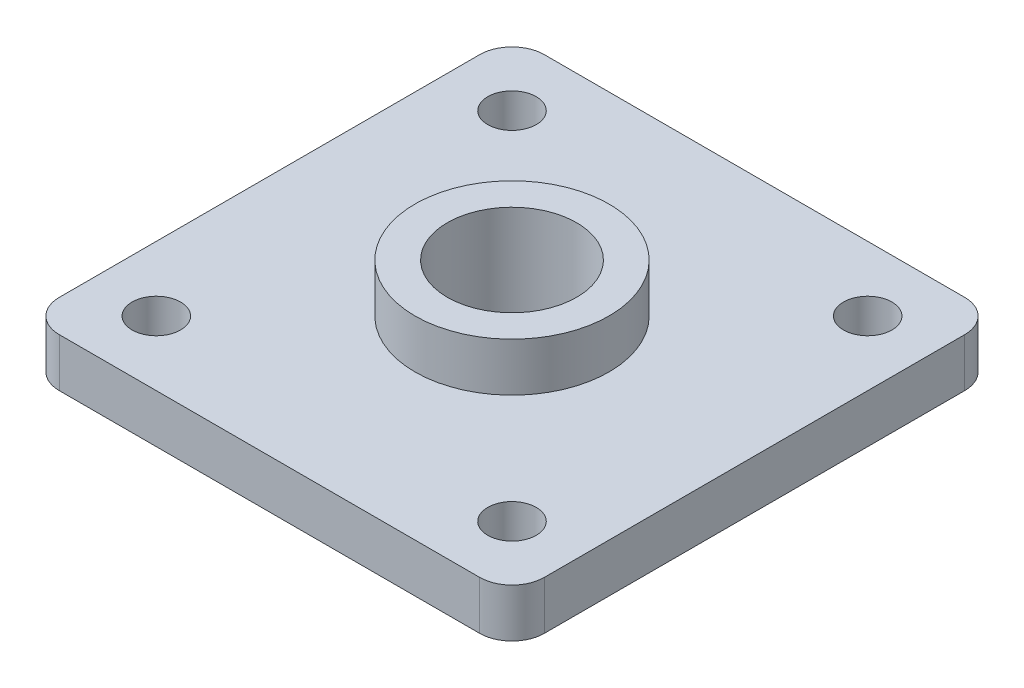
ISO-10303-21;
HEADER;
FILE_DESCRIPTION(('STEP AP214'),'2;1');
FILE_NAME('part.step','',(''),(''),'','','');
FILE_SCHEMA(('AUTOMOTIVE_DESIGN { 1 0 10303 214 1 1 1 1 }'));
ENDSEC;
DATA;
#1=APPLICATION_CONTEXT('core data for automotive mechanical design processes');
#2=APPLICATION_PROTOCOL_DEFINITION('international standard','automotive_design',2000,#1);
#3=PRODUCT_CONTEXT('',#1,'mechanical');
#4=PRODUCT('Part','Part','',(#3));
#5=PRODUCT_RELATED_PRODUCT_CATEGORY('part','',(#4));
#6=PRODUCT_DEFINITION_FORMATION('','',#4);
#7=PRODUCT_DEFINITION_CONTEXT('part definition',#1,'design');
#8=PRODUCT_DEFINITION('design','',#6,#7);
#9=PRODUCT_DEFINITION_SHAPE('','',#8);
#10=(LENGTH_UNIT() NAMED_UNIT(*) SI_UNIT(.MILLI.,.METRE.));
#11=(NAMED_UNIT(*) PLANE_ANGLE_UNIT() SI_UNIT($,.RADIAN.));
#12=(NAMED_UNIT(*) SI_UNIT($,.STERADIAN.) SOLID_ANGLE_UNIT());
#13=UNCERTAINTY_MEASURE_WITH_UNIT(LENGTH_MEASURE(1.E-05),#10,'distance_accuracy_value','');
#14=(GEOMETRIC_REPRESENTATION_CONTEXT(3) GLOBAL_UNCERTAINTY_ASSIGNED_CONTEXT((#13)) GLOBAL_UNIT_ASSIGNED_CONTEXT((#10,
#11,#12)) REPRESENTATION_CONTEXT('',''));
#15=CARTESIAN_POINT('',(0.,0.,0.));
#16=DIRECTION('',(0.,0.,1.));
#17=DIRECTION('',(1.,0.,0.));
#18=AXIS2_PLACEMENT_3D('',#15,#16,#17);
#19=CARTESIAN_POINT('',(-47.625,9.525,47.625));
#20=DIRECTION('',(0.,1.,0.));
#21=DIRECTION('',(0.,0.,1.));
#22=AXIS2_PLACEMENT_3D('',#19,#20,#21);
#23=PLANE('',#22);
#24=CARTESIAN_POINT('',(34.925,9.525,34.925));
#25=DIRECTION('',(0.,1.,0.));
#26=DIRECTION('',(0.,0.,1.));
#27=AXIS2_PLACEMENT_3D('',#24,#25,#26);
#28=CIRCLE('',#27,4.7625);
#29=CARTESIAN_POINT('',(34.925,9.525,39.6875));
#30=VERTEX_POINT('',#29);
#31=EDGE_CURVE('E338',#30,#30,#28,.T.);
#32=ORIENTED_EDGE('',*,*,#31,.F.);
#33=EDGE_LOOP('',(#32));
#34=FACE_BOUND('',#33,.T.);
#35=CARTESIAN_POINT('',(-34.925,9.525,34.925));
#36=DIRECTION('',(0.,1.,0.));
#37=DIRECTION('',(0.,0.,1.));
#38=AXIS2_PLACEMENT_3D('',#35,#36,#37);
#39=CIRCLE('',#38,4.7625);
#40=CARTESIAN_POINT('',(-34.925,9.525,39.6875));
#41=VERTEX_POINT('',#40);
#42=EDGE_CURVE('E342',#41,#41,#39,.T.);
#43=ORIENTED_EDGE('',*,*,#42,.F.);
#44=EDGE_LOOP('',(#43));
#45=FACE_BOUND('',#44,.T.);
#46=CARTESIAN_POINT('',(-34.925,9.525,-34.925));
#47=DIRECTION('',(0.,1.,0.));
#48=DIRECTION('',(0.,0.,1.));
#49=AXIS2_PLACEMENT_3D('',#46,#47,#48);
#50=CIRCLE('',#49,4.7625);
#51=CARTESIAN_POINT('',(-34.925,9.525,-30.1625));
#52=VERTEX_POINT('',#51);
#53=EDGE_CURVE('E351',#52,#52,#50,.T.);
#54=ORIENTED_EDGE('',*,*,#53,.F.);
#55=EDGE_LOOP('',(#54));
#56=FACE_BOUND('',#55,.T.);
#57=CARTESIAN_POINT('',(34.925,9.525,-34.925));
#58=DIRECTION('',(0.,1.,0.));
#59=DIRECTION('',(0.,0.,1.));
#60=AXIS2_PLACEMENT_3D('',#57,#58,#59);
#61=CIRCLE('',#60,4.7625);
#62=CARTESIAN_POINT('',(34.925,9.525,-30.1625));
#63=VERTEX_POINT('',#62);
#64=EDGE_CURVE('E357',#63,#63,#61,.T.);
#65=ORIENTED_EDGE('',*,*,#64,.F.);
#66=EDGE_LOOP('',(#65));
#67=FACE_BOUND('',#66,.T.);
#68=DIRECTION('',(-1.,0.,0.));
#69=VECTOR('',#68,1.);
#70=CARTESIAN_POINT('',(-47.625,9.525,-47.625));
#71=LINE('',#70,#69);
#72=CARTESIAN_POINT('',(41.275,9.525,-47.625));
#73=VERTEX_POINT('',#72);
#74=CARTESIAN_POINT('',(-41.275,9.525,-47.625));
#75=VERTEX_POINT('',#74);
#76=EDGE_CURVE('E143',#73,#75,#71,.T.);
#77=ORIENTED_EDGE('',*,*,#76,.T.);
#78=CARTESIAN_POINT('',(-41.275,9.525,-41.275));
#79=DIRECTION('',(0.,1.,0.));
#80=DIRECTION('',(0.,0.,1.));
#81=AXIS2_PLACEMENT_3D('',#78,#79,#80);
#82=CIRCLE('',#81,6.35);
#83=CARTESIAN_POINT('',(-47.625,9.525,-41.275));
#84=VERTEX_POINT('',#83);
#85=EDGE_CURVE('E158',#75,#84,#82,.T.);
#86=ORIENTED_EDGE('',*,*,#85,.T.);
#87=DIRECTION('',(0.,0.,1.));
#88=VECTOR('',#87,1.);
#89=CARTESIAN_POINT('',(-47.625,9.525,-47.625));
#90=LINE('',#89,#88);
#91=CARTESIAN_POINT('',(-47.625,9.525,41.275));
#92=VERTEX_POINT('',#91);
#93=EDGE_CURVE('E117',#84,#92,#90,.T.);
#94=ORIENTED_EDGE('',*,*,#93,.T.);
#95=CARTESIAN_POINT('',(-41.275,9.525,41.275));
#96=DIRECTION('',(0.,1.,0.));
#97=DIRECTION('',(0.,0.,1.));
#98=AXIS2_PLACEMENT_3D('',#95,#96,#97);
#99=CIRCLE('',#98,6.35);
#100=CARTESIAN_POINT('',(-41.275,9.525,47.625));
#101=VERTEX_POINT('',#100);
#102=EDGE_CURVE('E154',#92,#101,#99,.T.);
#103=ORIENTED_EDGE('',*,*,#102,.T.);
#104=DIRECTION('',(1.,0.,0.));
#105=VECTOR('',#104,1.);
#106=CARTESIAN_POINT('',(-47.625,9.525,47.625));
#107=LINE('',#106,#105);
#108=CARTESIAN_POINT('',(41.275,9.525,47.625));
#109=VERTEX_POINT('',#108);
#110=EDGE_CURVE('E139',#101,#109,#107,.T.);
#111=ORIENTED_EDGE('',*,*,#110,.T.);
#112=CARTESIAN_POINT('',(41.275,9.525,41.275));
#113=DIRECTION('',(0.,1.,0.));
#114=DIRECTION('',(0.,0.,1.));
#115=AXIS2_PLACEMENT_3D('',#112,#113,#114);
#116=CIRCLE('',#115,6.35);
#117=CARTESIAN_POINT('',(47.625,9.525,41.275));
#118=VERTEX_POINT('',#117);
#119=EDGE_CURVE('E53',#109,#118,#116,.T.);
#120=ORIENTED_EDGE('',*,*,#119,.T.);
#121=DIRECTION('',(0.,0.,-1.));
#122=VECTOR('',#121,1.);
#123=CARTESIAN_POINT('',(47.625,9.525,-47.625));
#124=LINE('',#123,#122);
#125=CARTESIAN_POINT('',(47.625,9.525,-41.275));
#126=VERTEX_POINT('',#125);
#127=EDGE_CURVE('E141',#118,#126,#124,.T.);
#128=ORIENTED_EDGE('',*,*,#127,.T.);
#129=CARTESIAN_POINT('',(41.275,9.525,-41.275));
#130=DIRECTION('',(0.,1.,0.));
#131=DIRECTION('',(0.,0.,1.));
#132=AXIS2_PLACEMENT_3D('',#129,#130,#131);
#133=CIRCLE('',#132,6.35);
#134=EDGE_CURVE('E156',#126,#73,#133,.T.);
#135=ORIENTED_EDGE('',*,*,#134,.T.);
#136=EDGE_LOOP('',(#77,#86,#94,#103,#111,#120,#128,#135));
#137=FACE_BOUND('',#136,.T.);
#138=CARTESIAN_POINT('',(0.,9.525,0.));
#139=DIRECTION('',(0.,1.,0.));
#140=DIRECTION('',(0.,0.,1.));
#141=AXIS2_PLACEMENT_3D('',#138,#139,#140);
#142=CIRCLE('',#141,19.05);
#143=CARTESIAN_POINT('',(0.,9.525,19.05));
#144=VERTEX_POINT('',#143);
#145=EDGE_CURVE('E131',#144,#144,#142,.T.);
#146=ORIENTED_EDGE('',*,*,#145,.F.);
#147=EDGE_LOOP('',(#146));
#148=FACE_BOUND('',#147,.T.);
#149=ADVANCED_FACE('F31',(#34,#45,#56,#67,#137,#148),#23,.T.);
#150=CARTESIAN_POINT('',(-47.625,9.525,-47.625));
#151=DIRECTION('',(1.,0.,0.));
#152=DIRECTION('',(0.,0.,-1.));
#153=AXIS2_PLACEMENT_3D('',#150,#151,#152);
#154=PLANE('',#153);
#155=ORIENTED_EDGE('',*,*,#93,.F.);
#156=DIRECTION('',(0.,-1.,0.));
#157=VECTOR('',#156,1.);
#158=CARTESIAN_POINT('',(-47.625,9.525,-41.275));
#159=LINE('',#158,#157);
#160=CARTESIAN_POINT('',(-47.625,0.,-41.275));
#161=VERTEX_POINT('',#160);
#162=EDGE_CURVE('E102',#84,#161,#159,.T.);
#163=ORIENTED_EDGE('',*,*,#162,.T.);
#164=DIRECTION('',(0.,0.,1.));
#165=VECTOR('',#164,1.);
#166=CARTESIAN_POINT('',(-47.625,0.,-47.625));
#167=LINE('',#166,#165);
#168=CARTESIAN_POINT('',(-47.625,0.,41.275));
#169=VERTEX_POINT('',#168);
#170=EDGE_CURVE('E114',#161,#169,#167,.T.);
#171=ORIENTED_EDGE('',*,*,#170,.T.);
#172=DIRECTION('',(0.,-1.,0.));
#173=VECTOR('',#172,1.);
#174=CARTESIAN_POINT('',(-47.625,9.525,41.275));
#175=LINE('',#174,#173);
#176=EDGE_CURVE('E119',#169,#92,#175,.F.);
#177=ORIENTED_EDGE('',*,*,#176,.T.);
#178=EDGE_LOOP('',(#155,#163,#171,#177));
#179=FACE_BOUND('',#178,.T.);
#180=ADVANCED_FACE('F33',(#179),#154,.F.);
#181=CARTESIAN_POINT('',(-47.625,9.525,47.625));
#182=DIRECTION('',(0.,0.,-1.));
#183=DIRECTION('',(-1.,0.,0.));
#184=AXIS2_PLACEMENT_3D('',#181,#182,#183);
#185=PLANE('',#184);
#186=ORIENTED_EDGE('',*,*,#110,.F.);
#187=DIRECTION('',(0.,-1.,0.));
#188=VECTOR('',#187,1.);
#189=CARTESIAN_POINT('',(-41.275,9.525,47.625));
#190=LINE('',#189,#188);
#191=CARTESIAN_POINT('',(-41.275,0.,47.625));
#192=VERTEX_POINT('',#191);
#193=EDGE_CURVE('E11',#101,#192,#190,.T.);
#194=ORIENTED_EDGE('',*,*,#193,.T.);
#195=DIRECTION('',(1.,0.,0.));
#196=VECTOR('',#195,1.);
#197=CARTESIAN_POINT('',(-47.625,0.,47.625));
#198=LINE('',#197,#196);
#199=CARTESIAN_POINT('',(41.275,0.,47.625));
#200=VERTEX_POINT('',#199);
#201=EDGE_CURVE('E124',#192,#200,#198,.T.);
#202=ORIENTED_EDGE('',*,*,#201,.T.);
#203=DIRECTION('',(0.,-1.,0.));
#204=VECTOR('',#203,1.);
#205=CARTESIAN_POINT('',(41.275,9.525,47.625));
#206=LINE('',#205,#204);
#207=EDGE_CURVE('E39',#200,#109,#206,.F.);
#208=ORIENTED_EDGE('',*,*,#207,.T.);
#209=EDGE_LOOP('',(#186,#194,#202,#208));
#210=FACE_BOUND('',#209,.T.);
#211=ADVANCED_FACE('F166',(#210),#185,.F.);
#212=CARTESIAN_POINT('',(47.625,9.525,-47.625));
#213=DIRECTION('',(-1.,0.,0.));
#214=DIRECTION('',(0.,0.,1.));
#215=AXIS2_PLACEMENT_3D('',#212,#213,#214);
#216=PLANE('',#215);
#217=DIRECTION('',(0.,0.,-1.));
#218=VECTOR('',#217,1.);
#219=CARTESIAN_POINT('',(47.625,0.,-47.625));
#220=LINE('',#219,#218);
#221=CARTESIAN_POINT('',(47.625,0.,41.275));
#222=VERTEX_POINT('',#221);
#223=CARTESIAN_POINT('',(47.625,0.,-41.275));
#224=VERTEX_POINT('',#223);
#225=EDGE_CURVE('E128',#222,#224,#220,.T.);
#226=ORIENTED_EDGE('',*,*,#225,.T.);
#227=DIRECTION('',(0.,-1.,0.));
#228=VECTOR('',#227,1.);
#229=CARTESIAN_POINT('',(47.625,9.525,-41.275));
#230=LINE('',#229,#228);
#231=EDGE_CURVE('E46',#224,#126,#230,.F.);
#232=ORIENTED_EDGE('',*,*,#231,.T.);
#233=ORIENTED_EDGE('',*,*,#127,.F.);
#234=DIRECTION('',(0.,-1.,0.));
#235=VECTOR('',#234,1.);
#236=CARTESIAN_POINT('',(47.625,9.525,41.275));
#237=LINE('',#236,#235);
#238=EDGE_CURVE('E160',#118,#222,#237,.T.);
#239=ORIENTED_EDGE('',*,*,#238,.T.);
#240=EDGE_LOOP('',(#226,#232,#233,#239));
#241=FACE_BOUND('',#240,.T.);
#242=ADVANCED_FACE('F174',(#241),#216,.F.);
#243=CARTESIAN_POINT('',(-47.625,9.525,-47.625));
#244=DIRECTION('',(0.,0.,1.));
#245=DIRECTION('',(1.,0.,0.));
#246=AXIS2_PLACEMENT_3D('',#243,#244,#245);
#247=PLANE('',#246);
#248=DIRECTION('',(-1.,0.,0.));
#249=VECTOR('',#248,1.);
#250=CARTESIAN_POINT('',(-47.625,0.,-47.625));
#251=LINE('',#250,#249);
#252=CARTESIAN_POINT('',(41.275,0.,-47.625));
#253=VERTEX_POINT('',#252);
#254=CARTESIAN_POINT('',(-41.275,0.,-47.625));
#255=VERTEX_POINT('',#254);
#256=EDGE_CURVE('E136',#253,#255,#251,.T.);
#257=ORIENTED_EDGE('',*,*,#256,.T.);
#258=DIRECTION('',(0.,-1.,0.));
#259=VECTOR('',#258,1.);
#260=CARTESIAN_POINT('',(-41.275,9.525,-47.625));
#261=LINE('',#260,#259);
#262=EDGE_CURVE('E103',#255,#75,#261,.F.);
#263=ORIENTED_EDGE('',*,*,#262,.T.);
#264=ORIENTED_EDGE('',*,*,#76,.F.);
#265=DIRECTION('',(0.,-1.,0.));
#266=VECTOR('',#265,1.);
#267=CARTESIAN_POINT('',(41.275,9.525,-47.625));
#268=LINE('',#267,#266);
#269=EDGE_CURVE('E108',#73,#253,#268,.T.);
#270=ORIENTED_EDGE('',*,*,#269,.T.);
#271=EDGE_LOOP('',(#257,#263,#264,#270));
#272=FACE_BOUND('',#271,.T.);
#273=ADVANCED_FACE('F181',(#272),#247,.F.);
#274=CARTESIAN_POINT('',(-47.625,0.,47.625));
#275=DIRECTION('',(0.,1.,0.));
#276=DIRECTION('',(0.,0.,1.));
#277=AXIS2_PLACEMENT_3D('',#274,#275,#276);
#278=PLANE('',#277);
#279=CARTESIAN_POINT('',(34.925,0.,34.925));
#280=DIRECTION('',(0.,1.,0.));
#281=DIRECTION('',(0.,0.,1.));
#282=AXIS2_PLACEMENT_3D('',#279,#280,#281);
#283=CIRCLE('',#282,4.7625);
#284=CARTESIAN_POINT('',(34.925,0.,39.6875));
#285=VERTEX_POINT('',#284);
#286=EDGE_CURVE('E341',#285,#285,#283,.F.);
#287=ORIENTED_EDGE('',*,*,#286,.F.);
#288=EDGE_LOOP('',(#287));
#289=FACE_BOUND('',#288,.T.);
#290=CARTESIAN_POINT('',(-34.925,0.,34.925));
#291=DIRECTION('',(0.,1.,0.));
#292=DIRECTION('',(0.,0.,1.));
#293=AXIS2_PLACEMENT_3D('',#290,#291,#292);
#294=CIRCLE('',#293,4.7625);
#295=CARTESIAN_POINT('',(-34.925,0.,39.6875));
#296=VERTEX_POINT('',#295);
#297=EDGE_CURVE('E345',#296,#296,#294,.F.);
#298=ORIENTED_EDGE('',*,*,#297,.F.);
#299=EDGE_LOOP('',(#298));
#300=FACE_BOUND('',#299,.T.);
#301=CARTESIAN_POINT('',(-34.925,0.,-34.925));
#302=DIRECTION('',(0.,1.,0.));
#303=DIRECTION('',(0.,0.,1.));
#304=AXIS2_PLACEMENT_3D('',#301,#302,#303);
#305=CIRCLE('',#304,4.7625);
#306=CARTESIAN_POINT('',(-34.925,0.,-30.1625));
#307=VERTEX_POINT('',#306);
#308=EDGE_CURVE('E354',#307,#307,#305,.F.);
#309=ORIENTED_EDGE('',*,*,#308,.F.);
#310=EDGE_LOOP('',(#309));
#311=FACE_BOUND('',#310,.T.);
#312=CARTESIAN_POINT('',(34.925,0.,-34.925));
#313=DIRECTION('',(0.,1.,0.));
#314=DIRECTION('',(0.,0.,1.));
#315=AXIS2_PLACEMENT_3D('',#312,#313,#314);
#316=CIRCLE('',#315,4.7625);
#317=CARTESIAN_POINT('',(34.925,0.,-30.1625));
#318=VERTEX_POINT('',#317);
#319=EDGE_CURVE('E360',#318,#318,#316,.F.);
#320=ORIENTED_EDGE('',*,*,#319,.F.);
#321=EDGE_LOOP('',(#320));
#322=FACE_BOUND('',#321,.T.);
#323=CARTESIAN_POINT('',(0.,0.,0.));
#324=DIRECTION('',(0.,1.,0.));
#325=DIRECTION('',(0.,0.,1.));
#326=AXIS2_PLACEMENT_3D('',#323,#324,#325);
#327=CIRCLE('',#326,12.7);
#328=CARTESIAN_POINT('',(0.,0.,12.7));
#329=VERTEX_POINT('',#328);
#330=EDGE_CURVE('E366',#329,#329,#327,.T.);
#331=ORIENTED_EDGE('',*,*,#330,.T.);
#332=EDGE_LOOP('',(#331));
#333=FACE_BOUND('',#332,.T.);
#334=ORIENTED_EDGE('',*,*,#170,.F.);
#335=CARTESIAN_POINT('',(-41.275,0.,-41.275));
#336=DIRECTION('',(0.,1.,0.));
#337=DIRECTION('',(0.,0.,1.));
#338=AXIS2_PLACEMENT_3D('',#335,#336,#337);
#339=CIRCLE('',#338,6.35);
#340=EDGE_CURVE('E98',#161,#255,#339,.F.);
#341=ORIENTED_EDGE('',*,*,#340,.T.);
#342=ORIENTED_EDGE('',*,*,#256,.F.);
#343=CARTESIAN_POINT('',(41.275,0.,-41.275));
#344=DIRECTION('',(0.,1.,0.));
#345=DIRECTION('',(0.,0.,1.));
#346=AXIS2_PLACEMENT_3D('',#343,#344,#345);
#347=CIRCLE('',#346,6.35);
#348=EDGE_CURVE('E109',#253,#224,#347,.F.);
#349=ORIENTED_EDGE('',*,*,#348,.T.);
#350=ORIENTED_EDGE('',*,*,#225,.F.);
#351=CARTESIAN_POINT('',(41.275,0.,41.275));
#352=DIRECTION('',(0.,1.,0.));
#353=DIRECTION('',(0.,0.,1.));
#354=AXIS2_PLACEMENT_3D('',#351,#352,#353);
#355=CIRCLE('',#354,6.35);
#356=EDGE_CURVE('E118',#222,#200,#355,.F.);
#357=ORIENTED_EDGE('',*,*,#356,.T.);
#358=ORIENTED_EDGE('',*,*,#201,.F.);
#359=CARTESIAN_POINT('',(-41.275,0.,41.275));
#360=DIRECTION('',(0.,1.,0.));
#361=DIRECTION('',(0.,0.,1.));
#362=AXIS2_PLACEMENT_3D('',#359,#360,#361);
#363=CIRCLE('',#362,6.35);
#364=EDGE_CURVE('E123',#192,#169,#363,.F.);
#365=ORIENTED_EDGE('',*,*,#364,.T.);
#366=EDGE_LOOP('',(#334,#341,#342,#349,#350,#357,#358,#365));
#367=FACE_BOUND('',#366,.T.);
#368=ADVANCED_FACE('F121',(#289,#300,#311,#322,#333,#367),#278,.F.);
#369=CARTESIAN_POINT('',(0.,19.05,0.));
#370=DIRECTION('',(0.,-1.,0.));
#371=DIRECTION('',(0.,0.,-1.));
#372=AXIS2_PLACEMENT_3D('',#369,#370,#371);
#373=CYLINDRICAL_SURFACE('',#372,19.05);
#374=CARTESIAN_POINT('',(0.,19.05,0.));
#375=DIRECTION('',(0.,1.,0.));
#376=DIRECTION('',(0.,0.,1.));
#377=AXIS2_PLACEMENT_3D('',#374,#375,#376);
#378=CIRCLE('',#377,19.05);
#379=CARTESIAN_POINT('',(0.,19.05,19.05));
#380=VERTEX_POINT('',#379);
#381=EDGE_CURVE('E125',#380,#380,#378,.T.);
#382=ORIENTED_EDGE('',*,*,#381,.F.);
#383=EDGE_LOOP('',(#382));
#384=FACE_BOUND('',#383,.T.);
#385=ORIENTED_EDGE('',*,*,#145,.T.);
#386=EDGE_LOOP('',(#385));
#387=FACE_BOUND('',#386,.T.);
#388=ADVANCED_FACE('F227',(#384,#387),#373,.T.);
#389=CARTESIAN_POINT('',(0.,19.05,0.));
#390=DIRECTION('',(0.,1.,0.));
#391=DIRECTION('',(0.,0.,1.));
#392=AXIS2_PLACEMENT_3D('',#389,#390,#391);
#393=PLANE('',#392);
#394=CARTESIAN_POINT('',(0.,19.05,0.));
#395=DIRECTION('',(0.,1.,0.));
#396=DIRECTION('',(0.,0.,1.));
#397=AXIS2_PLACEMENT_3D('',#394,#395,#396);
#398=CIRCLE('',#397,12.7);
#399=CARTESIAN_POINT('',(0.,19.05,12.7));
#400=VERTEX_POINT('',#399);
#401=EDGE_CURVE('E363',#400,#400,#398,.T.);
#402=ORIENTED_EDGE('',*,*,#401,.F.);
#403=EDGE_LOOP('',(#402));
#404=FACE_BOUND('',#403,.T.);
#405=ORIENTED_EDGE('',*,*,#381,.T.);
#406=EDGE_LOOP('',(#405));
#407=FACE_BOUND('',#406,.T.);
#408=ADVANCED_FACE('F235',(#404,#407),#393,.T.);
#409=CARTESIAN_POINT('',(0.,0.,0.));
#410=DIRECTION('',(0.,1.,0.));
#411=DIRECTION('',(0.,0.,1.));
#412=AXIS2_PLACEMENT_3D('',#409,#410,#411);
#413=CYLINDRICAL_SURFACE('',#412,12.7);
#414=ORIENTED_EDGE('',*,*,#330,.F.);
#415=EDGE_LOOP('',(#414));
#416=FACE_BOUND('',#415,.T.);
#417=ORIENTED_EDGE('',*,*,#401,.T.);
#418=EDGE_LOOP('',(#417));
#419=FACE_BOUND('',#418,.T.);
#420=ADVANCED_FACE('F242',(#416,#419),#413,.F.);
#421=CARTESIAN_POINT('',(-41.275,9.525,-41.275));
#422=DIRECTION('',(0.,-1.,0.));
#423=DIRECTION('',(0.,0.,-1.));
#424=AXIS2_PLACEMENT_3D('',#421,#422,#423);
#425=CYLINDRICAL_SURFACE('',#424,6.35);
#426=ORIENTED_EDGE('',*,*,#85,.F.);
#427=ORIENTED_EDGE('',*,*,#262,.F.);
#428=ORIENTED_EDGE('',*,*,#340,.F.);
#429=ORIENTED_EDGE('',*,*,#162,.F.);
#430=EDGE_LOOP('',(#426,#427,#428,#429));
#431=FACE_BOUND('',#430,.T.);
#432=ADVANCED_FACE('F101',(#431),#425,.T.);
#433=CARTESIAN_POINT('',(41.275,9.525,-41.275));
#434=DIRECTION('',(0.,-1.,0.));
#435=DIRECTION('',(0.,0.,-1.));
#436=AXIS2_PLACEMENT_3D('',#433,#434,#435);
#437=CYLINDRICAL_SURFACE('',#436,6.35);
#438=ORIENTED_EDGE('',*,*,#134,.F.);
#439=ORIENTED_EDGE('',*,*,#231,.F.);
#440=ORIENTED_EDGE('',*,*,#348,.F.);
#441=ORIENTED_EDGE('',*,*,#269,.F.);
#442=EDGE_LOOP('',(#438,#439,#440,#441));
#443=FACE_BOUND('',#442,.T.);
#444=ADVANCED_FACE('F178',(#443),#437,.T.);
#445=CARTESIAN_POINT('',(-41.275,9.525,41.275));
#446=DIRECTION('',(0.,-1.,0.));
#447=DIRECTION('',(0.,0.,-1.));
#448=AXIS2_PLACEMENT_3D('',#445,#446,#447);
#449=CYLINDRICAL_SURFACE('',#448,6.35);
#450=ORIENTED_EDGE('',*,*,#102,.F.);
#451=ORIENTED_EDGE('',*,*,#176,.F.);
#452=ORIENTED_EDGE('',*,*,#364,.F.);
#453=ORIENTED_EDGE('',*,*,#193,.F.);
#454=EDGE_LOOP('',(#450,#451,#452,#453));
#455=FACE_BOUND('',#454,.T.);
#456=ADVANCED_FACE('F183',(#455),#449,.T.);
#457=CARTESIAN_POINT('',(41.275,9.525,41.275));
#458=DIRECTION('',(0.,-1.,0.));
#459=DIRECTION('',(0.,0.,-1.));
#460=AXIS2_PLACEMENT_3D('',#457,#458,#459);
#461=CYLINDRICAL_SURFACE('',#460,6.35);
#462=ORIENTED_EDGE('',*,*,#119,.F.);
#463=ORIENTED_EDGE('',*,*,#207,.F.);
#464=ORIENTED_EDGE('',*,*,#356,.F.);
#465=ORIENTED_EDGE('',*,*,#238,.F.);
#466=EDGE_LOOP('',(#462,#463,#464,#465));
#467=FACE_BOUND('',#466,.T.);
#468=ADVANCED_FACE('F172',(#467),#461,.T.);
#469=CARTESIAN_POINT('',(34.925,-0.000999999999999265,-34.925));
#470=DIRECTION('',(0.,1.,0.));
#471=DIRECTION('',(0.,0.,1.));
#472=AXIS2_PLACEMENT_3D('',#469,#470,#471);
#473=CYLINDRICAL_SURFACE('',#472,4.7625);
#474=ORIENTED_EDGE('',*,*,#64,.T.);
#475=EDGE_LOOP('',(#474));
#476=FACE_BOUND('',#475,.T.);
#477=ORIENTED_EDGE('',*,*,#319,.T.);
#478=EDGE_LOOP('',(#477));
#479=FACE_BOUND('',#478,.T.);
#480=ADVANCED_FACE('F190',(#476,#479),#473,.F.);
#481=CARTESIAN_POINT('',(-34.925,-0.000999999999999265,-34.925));
#482=DIRECTION('',(0.,1.,0.));
#483=DIRECTION('',(0.,0.,1.));
#484=AXIS2_PLACEMENT_3D('',#481,#482,#483);
#485=CYLINDRICAL_SURFACE('',#484,4.7625);
#486=ORIENTED_EDGE('',*,*,#53,.T.);
#487=EDGE_LOOP('',(#486));
#488=FACE_BOUND('',#487,.T.);
#489=ORIENTED_EDGE('',*,*,#308,.T.);
#490=EDGE_LOOP('',(#489));
#491=FACE_BOUND('',#490,.T.);
#492=ADVANCED_FACE('F302',(#488,#491),#485,.F.);
#493=CARTESIAN_POINT('',(-34.925,-0.000999999999999265,34.925));
#494=DIRECTION('',(0.,1.,0.));
#495=DIRECTION('',(0.,0.,1.));
#496=AXIS2_PLACEMENT_3D('',#493,#494,#495);
#497=CYLINDRICAL_SURFACE('',#496,4.7625);
#498=ORIENTED_EDGE('',*,*,#42,.T.);
#499=EDGE_LOOP('',(#498));
#500=FACE_BOUND('',#499,.T.);
#501=ORIENTED_EDGE('',*,*,#297,.T.);
#502=EDGE_LOOP('',(#501));
#503=FACE_BOUND('',#502,.T.);
#504=ADVANCED_FACE('F309',(#500,#503),#497,.F.);
#505=CARTESIAN_POINT('',(34.925,-0.000999999999999265,34.925));
#506=DIRECTION('',(0.,1.,0.));
#507=DIRECTION('',(0.,0.,1.));
#508=AXIS2_PLACEMENT_3D('',#505,#506,#507);
#509=CYLINDRICAL_SURFACE('',#508,4.7625);
#510=ORIENTED_EDGE('',*,*,#31,.T.);
#511=EDGE_LOOP('',(#510));
#512=FACE_BOUND('',#511,.T.);
#513=ORIENTED_EDGE('',*,*,#286,.T.);
#514=EDGE_LOOP('',(#513));
#515=FACE_BOUND('',#514,.T.);
#516=ADVANCED_FACE('F317',(#512,#515),#509,.F.);
#517=CLOSED_SHELL('',(#149,#180,#211,#242,#273,#368,#388,#408,#420,#432,#444,#456,#468,#480,
#492,#504,#516));
#518=MANIFOLD_SOLID_BREP('B2',#517);
#519=ADVANCED_BREP_SHAPE_REPRESENTATION('',(#18,#518),#14);
#520=SHAPE_DEFINITION_REPRESENTATION(#9,#519);
ENDSEC;
END-ISO-10303-21;
